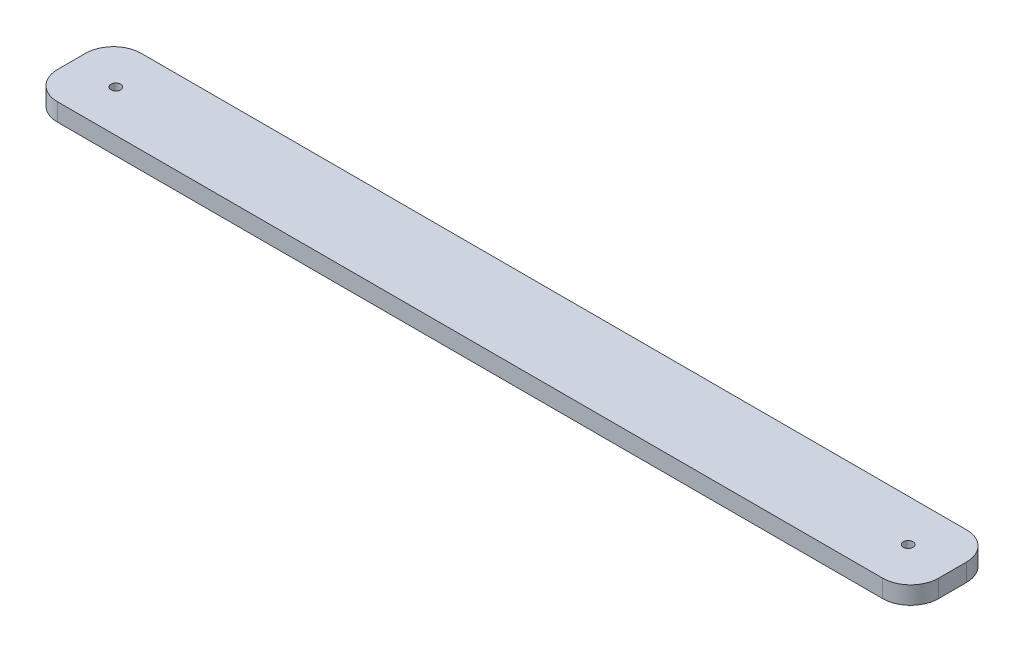
ISO-10303-21;
HEADER;
FILE_DESCRIPTION(('STEP AP214'),'2;1');
FILE_NAME('part.step','',(''),(''),'','','');
FILE_SCHEMA(('AUTOMOTIVE_DESIGN { 1 0 10303 214 1 1 1 1 }'));
ENDSEC;
DATA;
#1=APPLICATION_CONTEXT('core data for automotive mechanical design processes');
#2=APPLICATION_PROTOCOL_DEFINITION('international standard','automotive_design',2000,#1);
#3=PRODUCT_CONTEXT('',#1,'mechanical');
#4=PRODUCT('Part','Part','',(#3));
#5=PRODUCT_RELATED_PRODUCT_CATEGORY('part','',(#4));
#6=PRODUCT_DEFINITION_FORMATION('','',#4);
#7=PRODUCT_DEFINITION_CONTEXT('part definition',#1,'design');
#8=PRODUCT_DEFINITION('design','',#6,#7);
#9=PRODUCT_DEFINITION_SHAPE('','',#8);
#10=(LENGTH_UNIT() NAMED_UNIT(*) SI_UNIT(.MILLI.,.METRE.));
#11=(NAMED_UNIT(*) PLANE_ANGLE_UNIT() SI_UNIT($,.RADIAN.));
#12=(NAMED_UNIT(*) SI_UNIT($,.STERADIAN.) SOLID_ANGLE_UNIT());
#13=UNCERTAINTY_MEASURE_WITH_UNIT(LENGTH_MEASURE(1.E-05),#10,'distance_accuracy_value','');
#14=(GEOMETRIC_REPRESENTATION_CONTEXT(3) GLOBAL_UNCERTAINTY_ASSIGNED_CONTEXT((#13)) GLOBAL_UNIT_ASSIGNED_CONTEXT((#10,
#11,#12)) REPRESENTATION_CONTEXT('',''));
#15=CARTESIAN_POINT('',(0.,0.,0.));
#16=DIRECTION('',(0.,0.,1.));
#17=DIRECTION('',(1.,0.,0.));
#18=AXIS2_PLACEMENT_3D('',#15,#16,#17);
#19=CARTESIAN_POINT('',(157.695,6.35,-15.));
#20=DIRECTION('',(-1.,0.,0.));
#21=DIRECTION('',(0.,0.,1.));
#22=AXIS2_PLACEMENT_3D('',#19,#20,#21);
#23=PLANE('',#22);
#24=DIRECTION('',(0.,0.,-1.));
#25=VECTOR('',#24,1.);
#26=CARTESIAN_POINT('',(157.695,6.35,-15.));
#27=LINE('',#26,#25);
#28=CARTESIAN_POINT('',(157.695,6.35,4.99999999999999));
#29=VERTEX_POINT('',#28);
#30=CARTESIAN_POINT('',(157.695,6.35,-5.));
#31=VERTEX_POINT('',#30);
#32=EDGE_CURVE('E118',#29,#31,#27,.T.);
#33=ORIENTED_EDGE('',*,*,#32,.F.);
#34=DIRECTION('',(0.,-1.,0.));
#35=VECTOR('',#34,1.);
#36=CARTESIAN_POINT('',(157.695,6.35,4.99999999999999));
#37=LINE('',#36,#35);
#38=CARTESIAN_POINT('',(157.695,0.,4.99999999999999));
#39=VERTEX_POINT('',#38);
#40=EDGE_CURVE('E103',#29,#39,#37,.T.);
#41=ORIENTED_EDGE('',*,*,#40,.T.);
#42=DIRECTION('',(0.,0.,-1.));
#43=VECTOR('',#42,1.);
#44=CARTESIAN_POINT('',(157.695,0.,-15.));
#45=LINE('',#44,#43);
#46=CARTESIAN_POINT('',(157.695,0.,-5.));
#47=VERTEX_POINT('',#46);
#48=EDGE_CURVE('E115',#39,#47,#45,.T.);
#49=ORIENTED_EDGE('',*,*,#48,.T.);
#50=DIRECTION('',(0.,-1.,0.));
#51=VECTOR('',#50,1.);
#52=CARTESIAN_POINT('',(157.695,6.35,-5.));
#53=LINE('',#52,#51);
#54=EDGE_CURVE('E120',#47,#31,#53,.F.);
#55=ORIENTED_EDGE('',*,*,#54,.T.);
#56=EDGE_LOOP('',(#33,#41,#49,#55));
#57=FACE_BOUND('',#56,.T.);
#58=ADVANCED_FACE('F33',(#57),#23,.F.);
#59=CARTESIAN_POINT('',(-157.695,6.35,-15.));
#60=DIRECTION('',(0.,0.,1.));
#61=DIRECTION('',(1.,0.,0.));
#62=AXIS2_PLACEMENT_3D('',#59,#60,#61);
#63=PLANE('',#62);
#64=DIRECTION('',(-1.,0.,0.));
#65=VECTOR('',#64,1.);
#66=CARTESIAN_POINT('',(-157.695,0.,-15.));
#67=LINE('',#66,#65);
#68=CARTESIAN_POINT('',(147.695,0.,-15.));
#69=VERTEX_POINT('',#68);
#70=CARTESIAN_POINT('',(-147.695,0.,-15.));
#71=VERTEX_POINT('',#70);
#72=EDGE_CURVE('E124',#69,#71,#67,.T.);
#73=ORIENTED_EDGE('',*,*,#72,.T.);
#74=DIRECTION('',(0.,-1.,0.));
#75=VECTOR('',#74,1.);
#76=CARTESIAN_POINT('',(-147.695,6.35,-15.));
#77=LINE('',#76,#75);
#78=CARTESIAN_POINT('',(-147.695,6.35,-15.));
#79=VERTEX_POINT('',#78);
#80=EDGE_CURVE('E11',#71,#79,#77,.F.);
#81=ORIENTED_EDGE('',*,*,#80,.T.);
#82=DIRECTION('',(-1.,0.,0.));
#83=VECTOR('',#82,1.);
#84=CARTESIAN_POINT('',(-157.695,6.35,-15.));
#85=LINE('',#84,#83);
#86=CARTESIAN_POINT('',(147.695,6.35,-15.));
#87=VERTEX_POINT('',#86);
#88=EDGE_CURVE('E164',#87,#79,#85,.T.);
#89=ORIENTED_EDGE('',*,*,#88,.F.);
#90=DIRECTION('',(0.,-1.,0.));
#91=VECTOR('',#90,1.);
#92=CARTESIAN_POINT('',(147.695,6.35,-15.));
#93=LINE('',#92,#91);
#94=EDGE_CURVE('E41',#87,#69,#93,.T.);
#95=ORIENTED_EDGE('',*,*,#94,.T.);
#96=EDGE_LOOP('',(#73,#81,#89,#95));
#97=FACE_BOUND('',#96,.T.);
#98=ADVANCED_FACE('F162',(#97),#63,.F.);
#99=CARTESIAN_POINT('',(-157.695,6.35,-15.));
#100=DIRECTION('',(1.,0.,0.));
#101=DIRECTION('',(0.,0.,-1.));
#102=AXIS2_PLACEMENT_3D('',#99,#100,#101);
#103=PLANE('',#102);
#104=DIRECTION('',(0.,0.,1.));
#105=VECTOR('',#104,1.);
#106=CARTESIAN_POINT('',(-157.695,0.,-15.));
#107=LINE('',#106,#105);
#108=CARTESIAN_POINT('',(-157.695,0.,-5.));
#109=VERTEX_POINT('',#108);
#110=CARTESIAN_POINT('',(-157.695,0.,4.99999999999999));
#111=VERTEX_POINT('',#110);
#112=EDGE_CURVE('E128',#109,#111,#107,.T.);
#113=ORIENTED_EDGE('',*,*,#112,.T.);
#114=DIRECTION('',(0.,-1.,0.));
#115=VECTOR('',#114,1.);
#116=CARTESIAN_POINT('',(-157.695,6.35,4.99999999999999));
#117=LINE('',#116,#115);
#118=CARTESIAN_POINT('',(-157.695,6.35,4.99999999999999));
#119=VERTEX_POINT('',#118);
#120=EDGE_CURVE('E48',#111,#119,#117,.F.);
#121=ORIENTED_EDGE('',*,*,#120,.T.);
#122=DIRECTION('',(0.,0.,1.));
#123=VECTOR('',#122,1.);
#124=CARTESIAN_POINT('',(-157.695,6.35,-15.));
#125=LINE('',#124,#123);
#126=CARTESIAN_POINT('',(-157.695,6.35,-5.));
#127=VERTEX_POINT('',#126);
#128=EDGE_CURVE('E172',#127,#119,#125,.T.);
#129=ORIENTED_EDGE('',*,*,#128,.F.);
#130=DIRECTION('',(0.,-1.,0.));
#131=VECTOR('',#130,1.);
#132=CARTESIAN_POINT('',(-157.695,6.35,-5.));
#133=LINE('',#132,#131);
#134=EDGE_CURVE('E155',#127,#109,#133,.T.);
#135=ORIENTED_EDGE('',*,*,#134,.T.);
#136=EDGE_LOOP('',(#113,#121,#129,#135));
#137=FACE_BOUND('',#136,.T.);
#138=ADVANCED_FACE('F171',(#137),#103,.F.);
#139=CARTESIAN_POINT('',(-157.695,6.35,15.));
#140=DIRECTION('',(0.,0.,-1.));
#141=DIRECTION('',(-1.,0.,0.));
#142=AXIS2_PLACEMENT_3D('',#139,#140,#141);
#143=PLANE('',#142);
#144=DIRECTION('',(1.,0.,0.));
#145=VECTOR('',#144,1.);
#146=CARTESIAN_POINT('',(-157.695,0.,15.));
#147=LINE('',#146,#145);
#148=CARTESIAN_POINT('',(-147.695,0.,15.));
#149=VERTEX_POINT('',#148);
#150=CARTESIAN_POINT('',(147.695,0.,15.));
#151=VERTEX_POINT('',#150);
#152=EDGE_CURVE('E138',#149,#151,#147,.T.);
#153=ORIENTED_EDGE('',*,*,#152,.T.);
#154=DIRECTION('',(0.,-1.,0.));
#155=VECTOR('',#154,1.);
#156=CARTESIAN_POINT('',(147.695,6.35,15.));
#157=LINE('',#156,#155);
#158=CARTESIAN_POINT('',(147.695,6.35,15.));
#159=VERTEX_POINT('',#158);
#160=EDGE_CURVE('E104',#151,#159,#157,.F.);
#161=ORIENTED_EDGE('',*,*,#160,.T.);
#162=DIRECTION('',(1.,0.,0.));
#163=VECTOR('',#162,1.);
#164=CARTESIAN_POINT('',(-157.695,6.35,15.));
#165=LINE('',#164,#163);
#166=CARTESIAN_POINT('',(-147.695,6.35,15.));
#167=VERTEX_POINT('',#166);
#168=EDGE_CURVE('E134',#167,#159,#165,.T.);
#169=ORIENTED_EDGE('',*,*,#168,.F.);
#170=DIRECTION('',(0.,-1.,0.));
#171=VECTOR('',#170,1.);
#172=CARTESIAN_POINT('',(-147.695,6.35,15.));
#173=LINE('',#172,#171);
#174=EDGE_CURVE('E109',#167,#149,#173,.T.);
#175=ORIENTED_EDGE('',*,*,#174,.T.);
#176=EDGE_LOOP('',(#153,#161,#169,#175));
#177=FACE_BOUND('',#176,.T.);
#178=ADVANCED_FACE('F199',(#177),#143,.F.);
#179=CARTESIAN_POINT('',(0.,6.35,0.));
#180=DIRECTION('',(0.,1.,0.));
#181=DIRECTION('',(0.,0.,1.));
#182=AXIS2_PLACEMENT_3D('',#179,#180,#181);
#183=PLANE('',#182);
#184=CARTESIAN_POINT('',(141.815,6.35,0.));
#185=DIRECTION('',(0.,1.,0.));
#186=DIRECTION('',(0.,0.,1.));
#187=AXIS2_PLACEMENT_3D('',#184,#185,#186);
#188=CIRCLE('',#187,1.75000000000001);
#189=CARTESIAN_POINT('',(141.815,6.35,1.75000000000001));
#190=VERTEX_POINT('',#189);
#191=EDGE_CURVE('E181',#190,#190,#188,.T.);
#192=ORIENTED_EDGE('',*,*,#191,.F.);
#193=EDGE_LOOP('',(#192));
#194=FACE_BOUND('',#193,.T.);
#195=CARTESIAN_POINT('',(-141.815,6.35,0.));
#196=DIRECTION('',(0.,1.,0.));
#197=DIRECTION('',(0.,0.,1.));
#198=AXIS2_PLACEMENT_3D('',#195,#196,#197);
#199=CIRCLE('',#198,1.75000000000001);
#200=CARTESIAN_POINT('',(-141.815,6.35,1.75000000000001));
#201=VERTEX_POINT('',#200);
#202=EDGE_CURVE('E131',#201,#201,#199,.T.);
#203=ORIENTED_EDGE('',*,*,#202,.F.);
#204=EDGE_LOOP('',(#203));
#205=FACE_BOUND('',#204,.T.);
#206=ORIENTED_EDGE('',*,*,#168,.T.);
#207=CARTESIAN_POINT('',(147.695,6.35,4.99999999999999));
#208=DIRECTION('',(0.,1.,0.));
#209=DIRECTION('',(0.,0.,1.));
#210=AXIS2_PLACEMENT_3D('',#207,#208,#209);
#211=CIRCLE('',#210,10.);
#212=EDGE_CURVE('E153',#159,#29,#211,.T.);
#213=ORIENTED_EDGE('',*,*,#212,.T.);
#214=ORIENTED_EDGE('',*,*,#32,.T.);
#215=CARTESIAN_POINT('',(147.695,6.35,-5.));
#216=DIRECTION('',(0.,1.,0.));
#217=DIRECTION('',(0.,0.,1.));
#218=AXIS2_PLACEMENT_3D('',#215,#216,#217);
#219=CIRCLE('',#218,10.);
#220=EDGE_CURVE('E148',#31,#87,#219,.T.);
#221=ORIENTED_EDGE('',*,*,#220,.T.);
#222=ORIENTED_EDGE('',*,*,#88,.T.);
#223=CARTESIAN_POINT('',(-147.695,6.35,-5.));
#224=DIRECTION('',(0.,1.,0.));
#225=DIRECTION('',(0.,0.,1.));
#226=AXIS2_PLACEMENT_3D('',#223,#224,#225);
#227=CIRCLE('',#226,10.);
#228=EDGE_CURVE('E55',#79,#127,#227,.T.);
#229=ORIENTED_EDGE('',*,*,#228,.T.);
#230=ORIENTED_EDGE('',*,*,#128,.T.);
#231=CARTESIAN_POINT('',(-147.695,6.35,5.));
#232=DIRECTION('',(0.,1.,0.));
#233=DIRECTION('',(0.,0.,1.));
#234=AXIS2_PLACEMENT_3D('',#231,#232,#233);
#235=CIRCLE('',#234,10.);
#236=EDGE_CURVE('E151',#119,#167,#235,.T.);
#237=ORIENTED_EDGE('',*,*,#236,.T.);
#238=EDGE_LOOP('',(#206,#213,#214,#221,#222,#229,#230,#237));
#239=FACE_BOUND('',#238,.T.);
#240=ADVANCED_FACE('F196',(#194,#205,#239),#183,.T.);
#241=CARTESIAN_POINT('',(0.,0.,0.));
#242=DIRECTION('',(0.,1.,0.));
#243=DIRECTION('',(0.,0.,1.));
#244=AXIS2_PLACEMENT_3D('',#241,#242,#243);
#245=PLANE('',#244);
#246=CARTESIAN_POINT('',(141.815,0.,0.));
#247=DIRECTION('',(0.,1.,0.));
#248=DIRECTION('',(0.,0.,1.));
#249=AXIS2_PLACEMENT_3D('',#246,#247,#248);
#250=CIRCLE('',#249,1.75000000000001);
#251=CARTESIAN_POINT('',(141.815,0.,1.75000000000001));
#252=VERTEX_POINT('',#251);
#253=EDGE_CURVE('E179',#252,#252,#250,.T.);
#254=ORIENTED_EDGE('',*,*,#253,.T.);
#255=EDGE_LOOP('',(#254));
#256=FACE_BOUND('',#255,.T.);
#257=CARTESIAN_POINT('',(-141.815,0.,0.));
#258=DIRECTION('',(0.,1.,0.));
#259=DIRECTION('',(0.,0.,1.));
#260=AXIS2_PLACEMENT_3D('',#257,#258,#259);
#261=CIRCLE('',#260,1.75000000000001);
#262=CARTESIAN_POINT('',(-141.815,0.,1.75000000000001));
#263=VERTEX_POINT('',#262);
#264=EDGE_CURVE('E125',#263,#263,#261,.T.);
#265=ORIENTED_EDGE('',*,*,#264,.T.);
#266=EDGE_LOOP('',(#265));
#267=FACE_BOUND('',#266,.T.);
#268=ORIENTED_EDGE('',*,*,#48,.F.);
#269=CARTESIAN_POINT('',(147.695,0.,4.99999999999999));
#270=DIRECTION('',(0.,1.,0.));
#271=DIRECTION('',(0.,0.,1.));
#272=AXIS2_PLACEMENT_3D('',#269,#270,#271);
#273=CIRCLE('',#272,10.);
#274=EDGE_CURVE('E99',#39,#151,#273,.F.);
#275=ORIENTED_EDGE('',*,*,#274,.T.);
#276=ORIENTED_EDGE('',*,*,#152,.F.);
#277=CARTESIAN_POINT('',(-147.695,0.,5.));
#278=DIRECTION('',(0.,1.,0.));
#279=DIRECTION('',(0.,0.,1.));
#280=AXIS2_PLACEMENT_3D('',#277,#278,#279);
#281=CIRCLE('',#280,10.);
#282=EDGE_CURVE('E110',#149,#111,#281,.F.);
#283=ORIENTED_EDGE('',*,*,#282,.T.);
#284=ORIENTED_EDGE('',*,*,#112,.F.);
#285=CARTESIAN_POINT('',(-147.695,0.,-5.));
#286=DIRECTION('',(0.,1.,0.));
#287=DIRECTION('',(0.,0.,1.));
#288=AXIS2_PLACEMENT_3D('',#285,#286,#287);
#289=CIRCLE('',#288,10.);
#290=EDGE_CURVE('E142',#109,#71,#289,.F.);
#291=ORIENTED_EDGE('',*,*,#290,.T.);
#292=ORIENTED_EDGE('',*,*,#72,.F.);
#293=CARTESIAN_POINT('',(147.695,0.,-5.));
#294=DIRECTION('',(0.,1.,0.));
#295=DIRECTION('',(0.,0.,1.));
#296=AXIS2_PLACEMENT_3D('',#293,#294,#295);
#297=CIRCLE('',#296,10.);
#298=EDGE_CURVE('E119',#69,#47,#297,.F.);
#299=ORIENTED_EDGE('',*,*,#298,.T.);
#300=EDGE_LOOP('',(#268,#275,#276,#283,#284,#291,#292,#299));
#301=FACE_BOUND('',#300,.T.);
#302=ADVANCED_FACE('F122',(#256,#267,#301),#245,.F.);
#303=CARTESIAN_POINT('',(-141.815,0.,0.));
#304=DIRECTION('',(0.,1.,0.));
#305=DIRECTION('',(0.,0.,1.));
#306=AXIS2_PLACEMENT_3D('',#303,#304,#305);
#307=CYLINDRICAL_SURFACE('',#306,1.75000000000001);
#308=ORIENTED_EDGE('',*,*,#264,.F.);
#309=EDGE_LOOP('',(#308));
#310=FACE_BOUND('',#309,.T.);
#311=ORIENTED_EDGE('',*,*,#202,.T.);
#312=EDGE_LOOP('',(#311));
#313=FACE_BOUND('',#312,.T.);
#314=ADVANCED_FACE('F192',(#310,#313),#307,.F.);
#315=CARTESIAN_POINT('',(141.815,0.,0.));
#316=DIRECTION('',(0.,1.,0.));
#317=DIRECTION('',(0.,0.,1.));
#318=AXIS2_PLACEMENT_3D('',#315,#316,#317);
#319=CYLINDRICAL_SURFACE('',#318,1.75000000000001);
#320=ORIENTED_EDGE('',*,*,#253,.F.);
#321=EDGE_LOOP('',(#320));
#322=FACE_BOUND('',#321,.T.);
#323=ORIENTED_EDGE('',*,*,#191,.T.);
#324=EDGE_LOOP('',(#323));
#325=FACE_BOUND('',#324,.T.);
#326=ADVANCED_FACE('F189',(#322,#325),#319,.F.);
#327=CARTESIAN_POINT('',(147.695,6.35,4.99999999999999));
#328=DIRECTION('',(0.,-1.,0.));
#329=DIRECTION('',(0.,0.,-1.));
#330=AXIS2_PLACEMENT_3D('',#327,#328,#329);
#331=CYLINDRICAL_SURFACE('',#330,10.);
#332=ORIENTED_EDGE('',*,*,#212,.F.);
#333=ORIENTED_EDGE('',*,*,#160,.F.);
#334=ORIENTED_EDGE('',*,*,#274,.F.);
#335=ORIENTED_EDGE('',*,*,#40,.F.);
#336=EDGE_LOOP('',(#332,#333,#334,#335));
#337=FACE_BOUND('',#336,.T.);
#338=ADVANCED_FACE('F102',(#337),#331,.T.);
#339=CARTESIAN_POINT('',(-147.695,6.35,5.));
#340=DIRECTION('',(0.,-1.,0.));
#341=DIRECTION('',(0.,0.,-1.));
#342=AXIS2_PLACEMENT_3D('',#339,#340,#341);
#343=CYLINDRICAL_SURFACE('',#342,10.);
#344=ORIENTED_EDGE('',*,*,#236,.F.);
#345=ORIENTED_EDGE('',*,*,#120,.F.);
#346=ORIENTED_EDGE('',*,*,#282,.F.);
#347=ORIENTED_EDGE('',*,*,#174,.F.);
#348=EDGE_LOOP('',(#344,#345,#346,#347));
#349=FACE_BOUND('',#348,.T.);
#350=ADVANCED_FACE('F206',(#349),#343,.T.);
#351=CARTESIAN_POINT('',(-147.695,6.35,-5.));
#352=DIRECTION('',(0.,-1.,0.));
#353=DIRECTION('',(0.,0.,-1.));
#354=AXIS2_PLACEMENT_3D('',#351,#352,#353);
#355=CYLINDRICAL_SURFACE('',#354,10.);
#356=ORIENTED_EDGE('',*,*,#228,.F.);
#357=ORIENTED_EDGE('',*,*,#80,.F.);
#358=ORIENTED_EDGE('',*,*,#290,.F.);
#359=ORIENTED_EDGE('',*,*,#134,.F.);
#360=EDGE_LOOP('',(#356,#357,#358,#359));
#361=FACE_BOUND('',#360,.T.);
#362=ADVANCED_FACE('F170',(#361),#355,.T.);
#363=CARTESIAN_POINT('',(147.695,6.35,-5.));
#364=DIRECTION('',(0.,-1.,0.));
#365=DIRECTION('',(0.,0.,-1.));
#366=AXIS2_PLACEMENT_3D('',#363,#364,#365);
#367=CYLINDRICAL_SURFACE('',#366,10.);
#368=ORIENTED_EDGE('',*,*,#220,.F.);
#369=ORIENTED_EDGE('',*,*,#54,.F.);
#370=ORIENTED_EDGE('',*,*,#298,.F.);
#371=ORIENTED_EDGE('',*,*,#94,.F.);
#372=EDGE_LOOP('',(#368,#369,#370,#371));
#373=FACE_BOUND('',#372,.T.);
#374=ADVANCED_FACE('F35',(#373),#367,.T.);
#375=CLOSED_SHELL('',(#58,#98,#138,#178,#240,#302,#314,#326,#338,#350,#362,#374));
#376=MANIFOLD_SOLID_BREP('B2',#375);
#377=ADVANCED_BREP_SHAPE_REPRESENTATION('',(#18,#376),#14);
#378=SHAPE_DEFINITION_REPRESENTATION(#9,#377);
ENDSEC;
END-ISO-10303-21;
